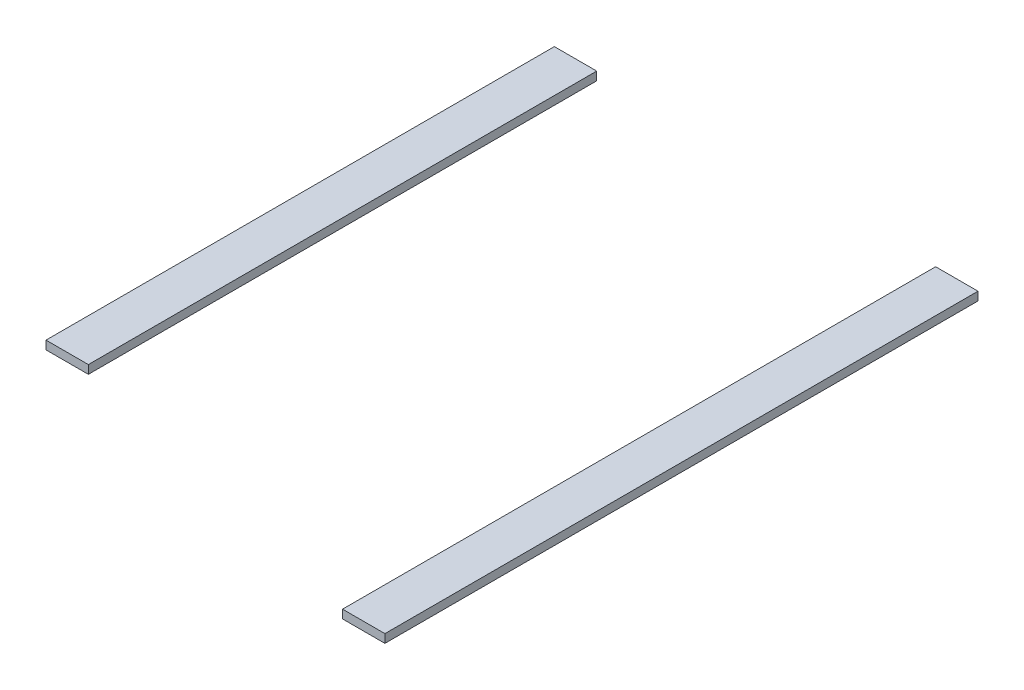
ISO-10303-21;
HEADER;
FILE_DESCRIPTION(('STEP AP214'),'2;1');
FILE_NAME('part.step','',(''),(''),'','','');
FILE_SCHEMA(('AUTOMOTIVE_DESIGN { 1 0 10303 214 1 1 1 1 }'));
ENDSEC;
DATA;
#1=APPLICATION_CONTEXT('core data for automotive mechanical design processes');
#2=APPLICATION_PROTOCOL_DEFINITION('international standard','automotive_design',2000,#1);
#3=PRODUCT_CONTEXT('',#1,'mechanical');
#4=PRODUCT('Part','Part','',(#3));
#5=PRODUCT_RELATED_PRODUCT_CATEGORY('part','',(#4));
#6=PRODUCT_DEFINITION_FORMATION('','',#4);
#7=PRODUCT_DEFINITION_CONTEXT('part definition',#1,'design');
#8=PRODUCT_DEFINITION('design','',#6,#7);
#9=PRODUCT_DEFINITION_SHAPE('','',#8);
#10=(LENGTH_UNIT() NAMED_UNIT(*) SI_UNIT(.MILLI.,.METRE.));
#11=(NAMED_UNIT(*) PLANE_ANGLE_UNIT() SI_UNIT($,.RADIAN.));
#12=(NAMED_UNIT(*) SI_UNIT($,.STERADIAN.) SOLID_ANGLE_UNIT());
#13=UNCERTAINTY_MEASURE_WITH_UNIT(LENGTH_MEASURE(1.E-05),#10,'distance_accuracy_value','');
#14=(GEOMETRIC_REPRESENTATION_CONTEXT(3) GLOBAL_UNCERTAINTY_ASSIGNED_CONTEXT((#13)) GLOBAL_UNIT_ASSIGNED_CONTEXT((#10,
#11,#12)) REPRESENTATION_CONTEXT('',''));
#15=CARTESIAN_POINT('',(0.,0.,0.));
#16=DIRECTION('',(0.,0.,1.));
#17=DIRECTION('',(1.,0.,0.));
#18=AXIS2_PLACEMENT_3D('',#15,#16,#17);
#19=CARTESIAN_POINT('',(23.75,0.5,-15.));
#20=DIRECTION('',(-1.,0.,0.));
#21=DIRECTION('',(0.,0.,1.));
#22=AXIS2_PLACEMENT_3D('',#19,#20,#21);
#23=PLANE('',#22);
#24=DIRECTION('',(0.,0.,-1.));
#25=VECTOR('',#24,1.);
#26=CARTESIAN_POINT('',(23.75,0.,-15.));
#27=LINE('',#26,#25);
#28=CARTESIAN_POINT('',(23.75,0.,20.));
#29=VERTEX_POINT('',#28);
#30=CARTESIAN_POINT('',(23.75,0.,-15.));
#31=VERTEX_POINT('',#30);
#32=EDGE_CURVE('E111',#29,#31,#27,.T.);
#33=ORIENTED_EDGE('',*,*,#32,.T.);
#34=DIRECTION('',(0.,-1.,0.));
#35=VECTOR('',#34,1.);
#36=CARTESIAN_POINT('',(23.75,0.5,-15.));
#37=LINE('',#36,#35);
#38=CARTESIAN_POINT('',(23.75,0.5,-15.));
#39=VERTEX_POINT('',#38);
#40=EDGE_CURVE('E12',#39,#31,#37,.T.);
#41=ORIENTED_EDGE('',*,*,#40,.F.);
#42=DIRECTION('',(0.,0.,-1.));
#43=VECTOR('',#42,1.);
#44=CARTESIAN_POINT('',(23.75,0.5,-15.));
#45=LINE('',#44,#43);
#46=CARTESIAN_POINT('',(23.75,0.5,20.));
#47=VERTEX_POINT('',#46);
#48=EDGE_CURVE('E99',#47,#39,#45,.T.);
#49=ORIENTED_EDGE('',*,*,#48,.F.);
#50=DIRECTION('',(0.,-1.,0.));
#51=VECTOR('',#50,1.);
#52=CARTESIAN_POINT('',(23.75,0.5,20.));
#53=LINE('',#52,#51);
#54=EDGE_CURVE('E107',#47,#29,#53,.T.);
#55=ORIENTED_EDGE('',*,*,#54,.T.);
#56=EDGE_LOOP('',(#33,#41,#49,#55));
#57=FACE_BOUND('',#56,.T.);
#58=ADVANCED_FACE('F48',(#57),#23,.F.);
#59=CARTESIAN_POINT('',(21.25,0.5,-15.));
#60=DIRECTION('',(0.,0.,1.));
#61=DIRECTION('',(1.,0.,0.));
#62=AXIS2_PLACEMENT_3D('',#59,#60,#61);
#63=PLANE('',#62);
#64=DIRECTION('',(-1.,0.,0.));
#65=VECTOR('',#64,1.);
#66=CARTESIAN_POINT('',(21.25,0.,-15.));
#67=LINE('',#66,#65);
#68=CARTESIAN_POINT('',(21.25,0.,-15.));
#69=VERTEX_POINT('',#68);
#70=EDGE_CURVE('E103',#31,#69,#67,.T.);
#71=ORIENTED_EDGE('',*,*,#70,.T.);
#72=DIRECTION('',(0.,-1.,0.));
#73=VECTOR('',#72,1.);
#74=CARTESIAN_POINT('',(21.25,0.5,-15.));
#75=LINE('',#74,#73);
#76=CARTESIAN_POINT('',(21.25,0.5,-15.));
#77=VERTEX_POINT('',#76);
#78=EDGE_CURVE('E56',#77,#69,#75,.T.);
#79=ORIENTED_EDGE('',*,*,#78,.F.);
#80=DIRECTION('',(-1.,0.,0.));
#81=VECTOR('',#80,1.);
#82=CARTESIAN_POINT('',(21.25,0.5,-15.));
#83=LINE('',#82,#81);
#84=EDGE_CURVE('E94',#39,#77,#83,.T.);
#85=ORIENTED_EDGE('',*,*,#84,.F.);
#86=ORIENTED_EDGE('',*,*,#40,.T.);
#87=EDGE_LOOP('',(#71,#79,#85,#86));
#88=FACE_BOUND('',#87,.T.);
#89=ADVANCED_FACE('F102',(#88),#63,.F.);
#90=CARTESIAN_POINT('',(21.25,0.5,-15.));
#91=DIRECTION('',(1.,0.,0.));
#92=DIRECTION('',(0.,0.,-1.));
#93=AXIS2_PLACEMENT_3D('',#90,#91,#92);
#94=PLANE('',#93);
#95=DIRECTION('',(0.,0.,1.));
#96=VECTOR('',#95,1.);
#97=CARTESIAN_POINT('',(21.25,0.,-15.));
#98=LINE('',#97,#96);
#99=CARTESIAN_POINT('',(21.25,0.,20.));
#100=VERTEX_POINT('',#99);
#101=EDGE_CURVE('E81',#69,#100,#98,.T.);
#102=ORIENTED_EDGE('',*,*,#101,.T.);
#103=DIRECTION('',(0.,-1.,0.));
#104=VECTOR('',#103,1.);
#105=CARTESIAN_POINT('',(21.25,0.5,20.));
#106=LINE('',#105,#104);
#107=CARTESIAN_POINT('',(21.25,0.5,20.));
#108=VERTEX_POINT('',#107);
#109=EDGE_CURVE('E104',#108,#100,#106,.T.);
#110=ORIENTED_EDGE('',*,*,#109,.F.);
#111=DIRECTION('',(0.,0.,1.));
#112=VECTOR('',#111,1.);
#113=CARTESIAN_POINT('',(21.25,0.5,-15.));
#114=LINE('',#113,#112);
#115=EDGE_CURVE('E97',#77,#108,#114,.T.);
#116=ORIENTED_EDGE('',*,*,#115,.F.);
#117=ORIENTED_EDGE('',*,*,#78,.T.);
#118=EDGE_LOOP('',(#102,#110,#116,#117));
#119=FACE_BOUND('',#118,.T.);
#120=ADVANCED_FACE('F105',(#119),#94,.F.);
#121=CARTESIAN_POINT('',(21.25,0.5,20.));
#122=DIRECTION('',(0.,0.,-1.));
#123=DIRECTION('',(-1.,0.,0.));
#124=AXIS2_PLACEMENT_3D('',#121,#122,#123);
#125=PLANE('',#124);
#126=DIRECTION('',(1.,0.,0.));
#127=VECTOR('',#126,1.);
#128=CARTESIAN_POINT('',(21.25,0.,20.));
#129=LINE('',#128,#127);
#130=EDGE_CURVE('E87',#100,#29,#129,.T.);
#131=ORIENTED_EDGE('',*,*,#130,.T.);
#132=ORIENTED_EDGE('',*,*,#54,.F.);
#133=DIRECTION('',(1.,0.,0.));
#134=VECTOR('',#133,1.);
#135=CARTESIAN_POINT('',(21.25,0.5,20.));
#136=LINE('',#135,#134);
#137=EDGE_CURVE('E64',#108,#47,#136,.T.);
#138=ORIENTED_EDGE('',*,*,#137,.F.);
#139=ORIENTED_EDGE('',*,*,#109,.T.);
#140=EDGE_LOOP('',(#131,#132,#138,#139));
#141=FACE_BOUND('',#140,.T.);
#142=ADVANCED_FACE('F118',(#141),#125,.F.);
#143=CARTESIAN_POINT('',(0.,0.5,0.));
#144=DIRECTION('',(0.,1.,0.));
#145=DIRECTION('',(0.,0.,1.));
#146=AXIS2_PLACEMENT_3D('',#143,#144,#145);
#147=PLANE('',#146);
#148=ORIENTED_EDGE('',*,*,#48,.T.);
#149=ORIENTED_EDGE('',*,*,#84,.T.);
#150=ORIENTED_EDGE('',*,*,#115,.T.);
#151=ORIENTED_EDGE('',*,*,#137,.T.);
#152=EDGE_LOOP('',(#148,#149,#150,#151));
#153=FACE_BOUND('',#152,.T.);
#154=ADVANCED_FACE('F95',(#153),#147,.T.);
#155=CARTESIAN_POINT('',(0.,0.,0.));
#156=DIRECTION('',(0.,1.,0.));
#157=DIRECTION('',(0.,0.,1.));
#158=AXIS2_PLACEMENT_3D('',#155,#156,#157);
#159=PLANE('',#158);
#160=ORIENTED_EDGE('',*,*,#32,.F.);
#161=ORIENTED_EDGE('',*,*,#130,.F.);
#162=ORIENTED_EDGE('',*,*,#101,.F.);
#163=ORIENTED_EDGE('',*,*,#70,.F.);
#164=EDGE_LOOP('',(#160,#161,#162,#163));
#165=FACE_BOUND('',#164,.T.);
#166=ADVANCED_FACE('F121',(#165),#159,.F.);
#167=CLOSED_SHELL('',(#58,#89,#120,#142,#154,#166));
#168=MANIFOLD_SOLID_BREP('B2',#167);
#169=CARTESIAN_POINT('',(1.25,0.5,-15.));
#170=DIRECTION('',(-1.,0.,0.));
#171=DIRECTION('',(0.,0.,1.));
#172=AXIS2_PLACEMENT_3D('',#169,#170,#171);
#173=PLANE('',#172);
#174=DIRECTION('',(0.,0.,-1.));
#175=VECTOR('',#174,1.);
#176=CARTESIAN_POINT('',(1.25,0.,-15.));
#177=LINE('',#176,#175);
#178=CARTESIAN_POINT('',(1.25,0.,15.));
#179=VERTEX_POINT('',#178);
#180=CARTESIAN_POINT('',(1.25,0.,-15.));
#181=VERTEX_POINT('',#180);
#182=EDGE_CURVE('E236',#179,#181,#177,.T.);
#183=ORIENTED_EDGE('',*,*,#182,.T.);
#184=DIRECTION('',(0.,-1.,0.));
#185=VECTOR('',#184,1.);
#186=CARTESIAN_POINT('',(1.25,0.5,-15.));
#187=LINE('',#186,#185);
#188=CARTESIAN_POINT('',(1.25,0.5,-15.));
#189=VERTEX_POINT('',#188);
#190=EDGE_CURVE('E46',#189,#181,#187,.T.);
#191=ORIENTED_EDGE('',*,*,#190,.F.);
#192=DIRECTION('',(0.,0.,-1.));
#193=VECTOR('',#192,1.);
#194=CARTESIAN_POINT('',(1.25,0.5,-15.));
#195=LINE('',#194,#193);
#196=CARTESIAN_POINT('',(1.25,0.5,15.));
#197=VERTEX_POINT('',#196);
#198=EDGE_CURVE('E224',#197,#189,#195,.T.);
#199=ORIENTED_EDGE('',*,*,#198,.F.);
#200=DIRECTION('',(0.,-1.,0.));
#201=VECTOR('',#200,1.);
#202=CARTESIAN_POINT('',(1.25,0.5,15.));
#203=LINE('',#202,#201);
#204=EDGE_CURVE('E232',#197,#179,#203,.T.);
#205=ORIENTED_EDGE('',*,*,#204,.T.);
#206=EDGE_LOOP('',(#183,#191,#199,#205));
#207=FACE_BOUND('',#206,.T.);
#208=ADVANCED_FACE('F173',(#207),#173,.F.);
#209=CARTESIAN_POINT('',(-1.25,0.5,-15.));
#210=DIRECTION('',(0.,0.,1.));
#211=DIRECTION('',(1.,0.,0.));
#212=AXIS2_PLACEMENT_3D('',#209,#210,#211);
#213=PLANE('',#212);
#214=DIRECTION('',(-1.,0.,0.));
#215=VECTOR('',#214,1.);
#216=CARTESIAN_POINT('',(-1.25,0.,-15.));
#217=LINE('',#216,#215);
#218=CARTESIAN_POINT('',(-1.25,0.,-15.));
#219=VERTEX_POINT('',#218);
#220=EDGE_CURVE('E228',#181,#219,#217,.T.);
#221=ORIENTED_EDGE('',*,*,#220,.T.);
#222=DIRECTION('',(0.,-1.,0.));
#223=VECTOR('',#222,1.);
#224=CARTESIAN_POINT('',(-1.25,0.5,-15.));
#225=LINE('',#224,#223);
#226=CARTESIAN_POINT('',(-1.25,0.5,-15.));
#227=VERTEX_POINT('',#226);
#228=EDGE_CURVE('E181',#227,#219,#225,.T.);
#229=ORIENTED_EDGE('',*,*,#228,.F.);
#230=DIRECTION('',(-1.,0.,0.));
#231=VECTOR('',#230,1.);
#232=CARTESIAN_POINT('',(-1.25,0.5,-15.));
#233=LINE('',#232,#231);
#234=EDGE_CURVE('E219',#189,#227,#233,.T.);
#235=ORIENTED_EDGE('',*,*,#234,.F.);
#236=ORIENTED_EDGE('',*,*,#190,.T.);
#237=EDGE_LOOP('',(#221,#229,#235,#236));
#238=FACE_BOUND('',#237,.T.);
#239=ADVANCED_FACE('F227',(#238),#213,.F.);
#240=CARTESIAN_POINT('',(-1.25,0.5,-15.));
#241=DIRECTION('',(1.,0.,0.));
#242=DIRECTION('',(0.,0.,-1.));
#243=AXIS2_PLACEMENT_3D('',#240,#241,#242);
#244=PLANE('',#243);
#245=DIRECTION('',(0.,0.,1.));
#246=VECTOR('',#245,1.);
#247=CARTESIAN_POINT('',(-1.25,0.,-15.));
#248=LINE('',#247,#246);
#249=CARTESIAN_POINT('',(-1.25,0.,15.));
#250=VERTEX_POINT('',#249);
#251=EDGE_CURVE('E206',#219,#250,#248,.T.);
#252=ORIENTED_EDGE('',*,*,#251,.T.);
#253=DIRECTION('',(0.,-1.,0.));
#254=VECTOR('',#253,1.);
#255=CARTESIAN_POINT('',(-1.25,0.5,15.));
#256=LINE('',#255,#254);
#257=CARTESIAN_POINT('',(-1.25,0.5,15.));
#258=VERTEX_POINT('',#257);
#259=EDGE_CURVE('E229',#258,#250,#256,.T.);
#260=ORIENTED_EDGE('',*,*,#259,.F.);
#261=DIRECTION('',(0.,0.,1.));
#262=VECTOR('',#261,1.);
#263=CARTESIAN_POINT('',(-1.25,0.5,-15.));
#264=LINE('',#263,#262);
#265=EDGE_CURVE('E222',#227,#258,#264,.T.);
#266=ORIENTED_EDGE('',*,*,#265,.F.);
#267=ORIENTED_EDGE('',*,*,#228,.T.);
#268=EDGE_LOOP('',(#252,#260,#266,#267));
#269=FACE_BOUND('',#268,.T.);
#270=ADVANCED_FACE('F230',(#269),#244,.F.);
#271=CARTESIAN_POINT('',(-1.25,0.5,15.));
#272=DIRECTION('',(0.,0.,-1.));
#273=DIRECTION('',(-1.,0.,0.));
#274=AXIS2_PLACEMENT_3D('',#271,#272,#273);
#275=PLANE('',#274);
#276=DIRECTION('',(1.,0.,0.));
#277=VECTOR('',#276,1.);
#278=CARTESIAN_POINT('',(-1.25,0.,15.));
#279=LINE('',#278,#277);
#280=EDGE_CURVE('E212',#250,#179,#279,.T.);
#281=ORIENTED_EDGE('',*,*,#280,.T.);
#282=ORIENTED_EDGE('',*,*,#204,.F.);
#283=DIRECTION('',(1.,0.,0.));
#284=VECTOR('',#283,1.);
#285=CARTESIAN_POINT('',(-1.25,0.5,15.));
#286=LINE('',#285,#284);
#287=EDGE_CURVE('E189',#258,#197,#286,.T.);
#288=ORIENTED_EDGE('',*,*,#287,.F.);
#289=ORIENTED_EDGE('',*,*,#259,.T.);
#290=EDGE_LOOP('',(#281,#282,#288,#289));
#291=FACE_BOUND('',#290,.T.);
#292=ADVANCED_FACE('F243',(#291),#275,.F.);
#293=CARTESIAN_POINT('',(0.,0.5,0.));
#294=DIRECTION('',(0.,1.,0.));
#295=DIRECTION('',(0.,0.,1.));
#296=AXIS2_PLACEMENT_3D('',#293,#294,#295);
#297=PLANE('',#296);
#298=ORIENTED_EDGE('',*,*,#198,.T.);
#299=ORIENTED_EDGE('',*,*,#234,.T.);
#300=ORIENTED_EDGE('',*,*,#265,.T.);
#301=ORIENTED_EDGE('',*,*,#287,.T.);
#302=EDGE_LOOP('',(#298,#299,#300,#301));
#303=FACE_BOUND('',#302,.T.);
#304=ADVANCED_FACE('F220',(#303),#297,.T.);
#305=CARTESIAN_POINT('',(0.,0.,0.));
#306=DIRECTION('',(0.,1.,0.));
#307=DIRECTION('',(0.,0.,1.));
#308=AXIS2_PLACEMENT_3D('',#305,#306,#307);
#309=PLANE('',#308);
#310=ORIENTED_EDGE('',*,*,#182,.F.);
#311=ORIENTED_EDGE('',*,*,#280,.F.);
#312=ORIENTED_EDGE('',*,*,#251,.F.);
#313=ORIENTED_EDGE('',*,*,#220,.F.);
#314=EDGE_LOOP('',(#310,#311,#312,#313));
#315=FACE_BOUND('',#314,.T.);
#316=ADVANCED_FACE('F246',(#315),#309,.F.);
#317=CLOSED_SHELL('',(#208,#239,#270,#292,#304,#316));
#318=MANIFOLD_SOLID_BREP('B6',#317);
#319=ADVANCED_BREP_SHAPE_REPRESENTATION('',(#18,#168,#318),#14);
#320=SHAPE_DEFINITION_REPRESENTATION(#9,#319);
ENDSEC;
END-ISO-10303-21;
